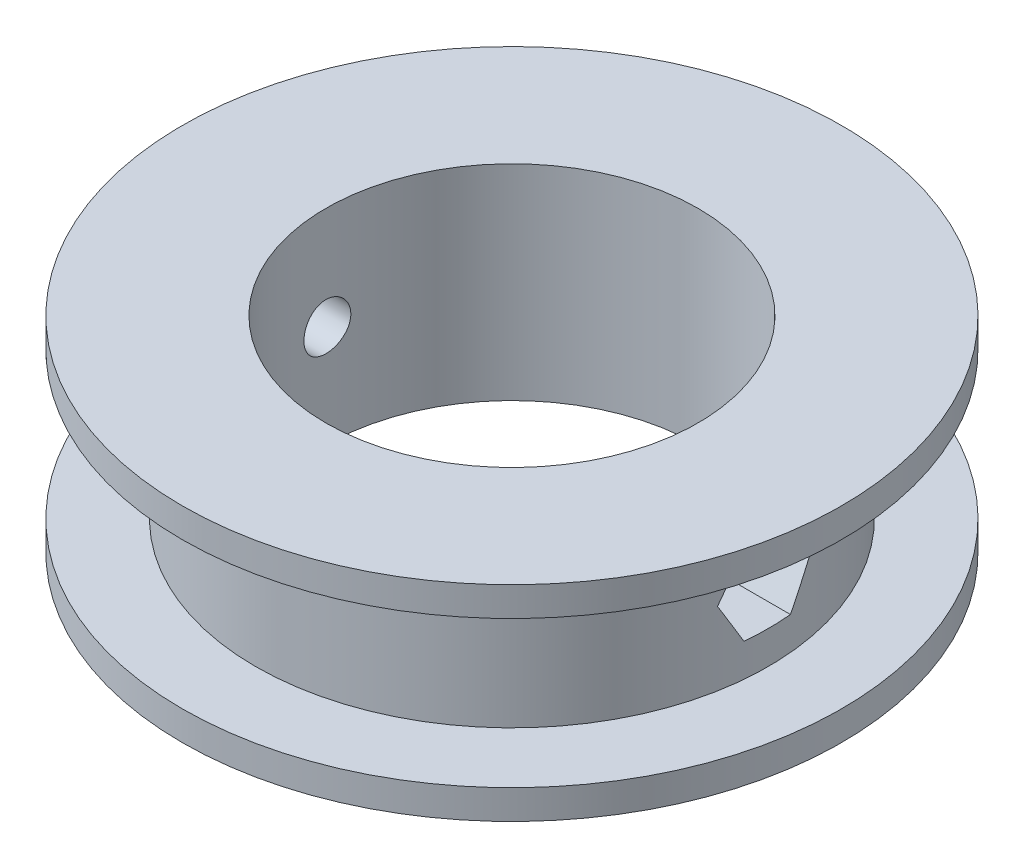
ISO-10303-21;
HEADER;
FILE_DESCRIPTION(('STEP AP214'),'2;1');
FILE_NAME('part.step','',(''),(''),'','','');
FILE_SCHEMA(('AUTOMOTIVE_DESIGN { 1 0 10303 214 1 1 1 1 }'));
ENDSEC;
DATA;
#1=APPLICATION_CONTEXT('core data for automotive mechanical design processes');
#2=APPLICATION_PROTOCOL_DEFINITION('international standard','automotive_design',2000,#1);
#3=PRODUCT_CONTEXT('',#1,'mechanical');
#4=PRODUCT('Part','Part','',(#3));
#5=PRODUCT_RELATED_PRODUCT_CATEGORY('part','',(#4));
#6=PRODUCT_DEFINITION_FORMATION('','',#4);
#7=PRODUCT_DEFINITION_CONTEXT('part definition',#1,'design');
#8=PRODUCT_DEFINITION('design','',#6,#7);
#9=PRODUCT_DEFINITION_SHAPE('','',#8);
#10=(LENGTH_UNIT() NAMED_UNIT(*) SI_UNIT(.MILLI.,.METRE.));
#11=(NAMED_UNIT(*) PLANE_ANGLE_UNIT() SI_UNIT($,.RADIAN.));
#12=(NAMED_UNIT(*) SI_UNIT($,.STERADIAN.) SOLID_ANGLE_UNIT());
#13=UNCERTAINTY_MEASURE_WITH_UNIT(LENGTH_MEASURE(1.E-05),#10,'distance_accuracy_value','');
#14=(GEOMETRIC_REPRESENTATION_CONTEXT(3) GLOBAL_UNCERTAINTY_ASSIGNED_CONTEXT((#13)) GLOBAL_UNIT_ASSIGNED_CONTEXT((#10,
#11,#12)) REPRESENTATION_CONTEXT('',''));
#15=CARTESIAN_POINT('',(0.,0.,0.));
#16=DIRECTION('',(0.,0.,1.));
#17=DIRECTION('',(1.,0.,0.));
#18=AXIS2_PLACEMENT_3D('',#15,#16,#17);
#19=CARTESIAN_POINT('',(0.,5.,0.));
#20=DIRECTION('',(0.,-1.,0.));
#21=DIRECTION('',(0.,0.,-1.));
#22=AXIS2_PLACEMENT_3D('',#19,#20,#21);
#23=CYLINDRICAL_SURFACE('',#22,17.5);
#24=CARTESIAN_POINT('',(-17.2825779327044,0.,-2.75));
#25=CARTESIAN_POINT('',(-17.2825805895696,0.153442042581324,-2.74999373034891));
#26=CARTESIAN_POINT('',(-17.2846435437698,0.306970963977942,-2.73711411245183));
#27=CARTESIAN_POINT('',(-17.292666075105,0.609729965441849,-2.68595323646897));
#28=CARTESIAN_POINT('',(-17.2986293666357,0.758955805988846,-2.64764776414423));
#29=CARTESIAN_POINT('',(-17.3137608611033,1.04868278521054,-2.54681493656312));
#30=CARTESIAN_POINT('',(-17.3229265129413,1.18919076419162,-2.48430685757308));
#31=CARTESIAN_POINT('',(-17.3434269683432,1.45770622636354,-2.33688970762635));
#32=CARTESIAN_POINT('',(-17.3547614959901,1.58571529649806,-2.25198348556577));
#33=CARTESIAN_POINT('',(-17.3784337658293,1.8267404702685,-2.06138492647557));
#34=CARTESIAN_POINT('',(-17.3907786852602,1.93963098126893,-1.95553463958274));
#35=CARTESIAN_POINT('',(-17.4150168462382,2.14612507710807,-1.7263938539673));
#36=CARTESIAN_POINT('',(-17.4269100621271,2.23972756765971,-1.603102366404));
#37=CARTESIAN_POINT('',(-17.4489802393982,2.40545539580079,-1.34177044439303));
#38=CARTESIAN_POINT('',(-17.4591477932692,2.4774645522685,-1.20365546957409));
#39=CARTESIAN_POINT('',(-17.4765413847317,2.59721556911259,-0.917104221216572));
#40=CARTESIAN_POINT('',(-17.4837675926036,2.64495883432952,-0.768668545746552));
#41=CARTESIAN_POINT('',(-17.4944136457174,2.71444063305924,-0.466984716410416));
#42=CARTESIAN_POINT('',(-17.4978643049025,2.7363897946332,-0.31378617802988));
#43=CARTESIAN_POINT('',(-17.5006761830715,2.75431474009059,-0.00584440984348317));
#44=CARTESIAN_POINT('',(-17.5000376504745,2.75029210176551,0.148898725557599));
#45=CARTESIAN_POINT('',(-17.4947676157738,2.71655303953866,0.454098783004018));
#46=CARTESIAN_POINT('',(-17.4901713348647,2.68706324875427,0.60458145352656));
#47=CARTESIAN_POINT('',(-17.4775414846515,2.60358319801336,0.898435570803033));
#48=CARTESIAN_POINT('',(-17.4695078199801,2.54959225829045,1.04180682013337));
#49=CARTESIAN_POINT('',(-17.4508455521261,2.41841333173695,1.31804929059045));
#50=CARTESIAN_POINT('',(-17.4402064042436,2.34113078023091,1.45087486452185));
#51=CARTESIAN_POINT('',(-17.4175173682006,2.16563153713493,1.70175791068199));
#52=CARTESIAN_POINT('',(-17.4054673783106,2.06741333554957,1.8198143167011));
#53=CARTESIAN_POINT('',(-17.3811454833272,1.85157060460223,2.03914507180665));
#54=CARTESIAN_POINT('',(-17.3688725866826,1.73374811385013,2.14022459556312));
#55=CARTESIAN_POINT('',(-17.3456144917806,1.48271160187598,2.32120868278056));
#56=CARTESIAN_POINT('',(-17.3346293029917,1.34949746749367,2.40111309054661));
#57=CARTESIAN_POINT('',(-17.3151903451046,1.0712465531021,2.53751003763762));
#58=CARTESIAN_POINT('',(-17.3067388973555,0.926199085495295,2.59398112603297));
#59=CARTESIAN_POINT('',(-17.2933642434654,0.628515457757791,2.68170486629699));
#60=CARTESIAN_POINT('',(-17.2884407630701,0.475879888491861,2.71295947844876));
#61=CARTESIAN_POINT('',(-17.2827319643323,0.169090277303433,2.7490928999403));
#62=CARTESIAN_POINT('',(-17.2819032171293,0.0149696200004372,2.75424853030764));
#63=CARTESIAN_POINT('',(-17.2843622624917,-0.291933785916068,2.73877348411145));
#64=CARTESIAN_POINT('',(-17.287649914389,-0.444716580068202,2.71814368870341));
#65=CARTESIAN_POINT('',(-17.2979313325471,-0.743740686187418,2.65191869631176));
#66=CARTESIAN_POINT('',(-17.3049044340258,-0.890013590270085,2.60646265626546));
#67=CARTESIAN_POINT('',(-17.3217538937273,-1.1728647192245,2.49202075358933));
#68=CARTESIAN_POINT('',(-17.3316304080729,-1.30944242227384,2.42303362560988));
#69=CARTESIAN_POINT('',(-17.3532755914614,-1.57026342019551,2.26282764429545));
#70=CARTESIAN_POINT('',(-17.365059176398,-1.69439584731303,2.17143034500166));
#71=CARTESIAN_POINT('',(-17.3891464103273,-1.92566022343115,1.96924520918163));
#72=CARTESIAN_POINT('',(-17.40145009166,-2.03279111328749,1.85845616551188));
#73=CARTESIAN_POINT('',(-17.4253276207352,-2.22801245852067,1.61941025859422));
#74=CARTESIAN_POINT('',(-17.4368937263404,-2.31591897575269,1.49100228996235));
#75=CARTESIAN_POINT('',(-17.4578710123511,-2.46891186344931,1.22108064393943));
#76=CARTESIAN_POINT('',(-17.4672822563014,-2.53399890686807,1.07956735318447));
#77=CARTESIAN_POINT('',(-17.4828556192697,-2.6392145461773,0.788014764613754));
#78=CARTESIAN_POINT('',(-17.4890305811137,-2.67944191064245,0.638011825624002));
#79=CARTESIAN_POINT('',(-17.4974897023281,-2.73411528776913,0.333275186585567));
#80=CARTESIAN_POINT('',(-17.4997741448636,-2.74856317675072,0.178541831666899));
#81=CARTESIAN_POINT('',(-17.5001915108245,-2.75121826956067,-0.129482967695254));
#82=CARTESIAN_POINT('',(-17.4983688560198,-2.73970625099108,-0.282772005113992));
#83=CARTESIAN_POINT('',(-17.4908668541199,-2.69137242444705,-0.58520519574339));
#84=CARTESIAN_POINT('',(-17.4851875230275,-2.65455072149142,-0.734349366149892));
#85=CARTESIAN_POINT('',(-17.4706075827448,-2.55674580696568,-1.02416947262133));
#86=CARTESIAN_POINT('',(-17.461709813644,-2.49578389328549,-1.16485274769007));
#87=CARTESIAN_POINT('',(-17.4416677957175,-2.35145950182709,-1.43403768262396));
#88=CARTESIAN_POINT('',(-17.4305234598058,-2.26809615563759,-1.56253886997843));
#89=CARTESIAN_POINT('',(-17.4070825714269,-2.08032820363992,-1.80513214062937));
#90=CARTESIAN_POINT('',(-17.3947753932017,-1.97571696807623,-1.91906328098401));
#91=CARTESIAN_POINT('',(-17.3704723950119,-1.74885733795565,-2.12785483520407));
#92=CARTESIAN_POINT('',(-17.3584766487013,-1.626604815249,-2.22271077290612));
#93=CARTESIAN_POINT('',(-17.3360745520905,-1.36703568770372,-2.39119403049872));
#94=CARTESIAN_POINT('',(-17.3256785395921,-1.22963021014508,-2.46468579758077));
#95=CARTESIAN_POINT('',(-17.3077745420186,-0.944322987684814,-2.58743529855431));
#96=CARTESIAN_POINT('',(-17.3002636079645,-0.796432144590057,-2.6367177923718));
#97=CARTESIAN_POINT('',(-17.290686677865,-0.539927416419488,-2.69866466762212));
#98=CARTESIAN_POINT('',(-17.2876623445896,-0.432885328618232,-2.71788537297047));
#99=CARTESIAN_POINT('',(-17.2836070463724,-0.217243329755753,-2.74355516296636));
#100=CARTESIAN_POINT('',(-17.2825760515316,-0.108643442085193,-2.75000443917758));
#101=CARTESIAN_POINT('',(-17.2825779327044,0.,-2.75));
#102=B_SPLINE_CURVE_WITH_KNOTS('',3,(#24,#25,#26,#27,#28,#29,#30,#31,#32,#33,#34,#35,#36,#37,
#38,#39,#40,#41,#42,#43,#44,#45,#46,#47,#48,#49,#50,#51,#52,#53,#54,#55,#56,#57,#58,#59,#60,#61,
#62,#63,#64,#65,#66,#67,#68,#69,#70,#71,#72,#73,#74,#75,#76,#77,#78,#79,#80,#81,#82,#83,#84,#85,
#86,#87,#88,#89,#90,#91,#92,#93,#94,#95,#96,#97,#98,#99,#100,#101),.UNSPECIFIED.,.T.,.F.,(4,2,2,
2,2,2,2,2,2,2,2,2,2,2,2,2,2,2,2,2,2,2,2,2,2,2,2,2,2,2,2,2,2,2,2,2,2,2,4),(0.,0.459928948135652,
0.92029653792692,1.38029821777602,1.8402414166318,2.30379542954695,2.76737573451166,
3.23340729811177,3.6994118783785,4.16158414370513,4.6237283322479,5.08180177228082,
5.53988792200226,5.99985956065164,6.45986438624406,6.92483271923071,7.38980447090911,
7.8552009251161,8.32056119676033,8.7809750883887,9.24137324689935,9.69921686245647,
10.1570851017625,10.6187248861304,11.0803934179787,11.5463026772245,12.0121981954892,
12.4762305858503,12.9402292009393,13.3992333912518,13.8582356770057,14.316833903432,
14.7754499103884,15.2387599757416,15.7021786343199,16.1684764682889,16.6342964001406,
16.9599503911197,17.2855994974499),.UNSPECIFIED.);
#103=CARTESIAN_POINT('',(-17.2825779327044,0.,-2.75));
#104=VERTEX_POINT('',#103);
#105=EDGE_CURVE('E45',#104,#104,#102,.T.);
#106=ORIENTED_EDGE('',*,*,#105,.T.);
#107=EDGE_LOOP('',(#106));
#108=FACE_BOUND('',#107,.T.);
#109=CARTESIAN_POINT('',(0.,-5.,0.));
#110=DIRECTION('',(0.,1.,0.));
#111=DIRECTION('',(0.,0.,1.));
#112=AXIS2_PLACEMENT_3D('',#109,#110,#111);
#113=CIRCLE('',#112,17.5);
#114=CARTESIAN_POINT('',(0.,-5.,17.5));
#115=VERTEX_POINT('',#114);
#116=EDGE_CURVE('E138',#115,#115,#113,.T.);
#117=ORIENTED_EDGE('',*,*,#116,.T.);
#118=EDGE_LOOP('',(#117));
#119=FACE_BOUND('',#118,.T.);
#120=CARTESIAN_POINT('',(0.,5.,0.));
#121=DIRECTION('',(0.,1.,0.));
#122=DIRECTION('',(0.,0.,1.));
#123=AXIS2_PLACEMENT_3D('',#120,#121,#122);
#124=CIRCLE('',#123,17.5);
#125=CARTESIAN_POINT('',(0.,5.,17.5));
#126=VERTEX_POINT('',#125);
#127=EDGE_CURVE('E151',#126,#126,#124,.T.);
#128=ORIENTED_EDGE('',*,*,#127,.F.);
#129=EDGE_LOOP('',(#128));
#130=FACE_BOUND('',#129,.T.);
#131=CARTESIAN_POINT('',(0.,-5.5,0.));
#132=DIRECTION('',(0.,0.5,0.866025403784439));
#133=DIRECTION('',(0.,-0.866025403784439,0.5));
#134=AXIS2_PLACEMENT_3D('',#131,#132,#133);
#135=ELLIPSE('',#134,35.,17.5);
#136=CARTESIAN_POINT('',(17.4278273650695,-2.75,-1.58771324027147));
#137=VERTEX_POINT('',#136);
#138=CARTESIAN_POINT('',(17.2094935040711,0.,-3.17542648054294));
#139=VERTEX_POINT('',#138);
#140=EDGE_CURVE('E110',#137,#139,#135,.T.);
#141=ORIENTED_EDGE('',*,*,#140,.F.);
#142=CARTESIAN_POINT('',(0.,-2.75,0.));
#143=DIRECTION('',(0.,1.,0.));
#144=DIRECTION('',(0.,0.,1.));
#145=AXIS2_PLACEMENT_3D('',#142,#143,#144);
#146=CIRCLE('',#145,17.5);
#147=CARTESIAN_POINT('',(17.4278273650695,-2.75,1.58771324027147));
#148=VERTEX_POINT('',#147);
#149=EDGE_CURVE('E98',#148,#137,#146,.T.);
#150=ORIENTED_EDGE('',*,*,#149,.F.);
#151=CARTESIAN_POINT('',(0.,-5.5,0.));
#152=DIRECTION('',(0.,0.5,-0.866025403784438));
#153=DIRECTION('',(0.,-0.866025403784439,-0.5));
#154=AXIS2_PLACEMENT_3D('',#151,#152,#153);
#155=ELLIPSE('',#154,35.,17.5);
#156=CARTESIAN_POINT('',(17.2094935040711,0.,3.17542648054294));
#157=VERTEX_POINT('',#156);
#158=EDGE_CURVE('E104',#157,#148,#155,.T.);
#159=ORIENTED_EDGE('',*,*,#158,.F.);
#160=CARTESIAN_POINT('',(0.,5.5,0.));
#161=DIRECTION('',(0.,-0.5,-0.866025403784439));
#162=DIRECTION('',(0.,-0.866025403784439,0.5));
#163=AXIS2_PLACEMENT_3D('',#160,#161,#162);
#164=ELLIPSE('',#163,35.,17.5);
#165=CARTESIAN_POINT('',(17.4278273650696,2.75,1.58771324027147));
#166=VERTEX_POINT('',#165);
#167=EDGE_CURVE('E268',#166,#157,#164,.T.);
#168=ORIENTED_EDGE('',*,*,#167,.F.);
#169=CARTESIAN_POINT('',(0.,2.75,0.));
#170=DIRECTION('',(0.,-1.,0.));
#171=DIRECTION('',(0.,0.,-1.));
#172=AXIS2_PLACEMENT_3D('',#169,#170,#171);
#173=CIRCLE('',#172,17.5);
#174=CARTESIAN_POINT('',(17.4278273650695,2.75,-1.58771324027147));
#175=VERTEX_POINT('',#174);
#176=EDGE_CURVE('E126',#175,#166,#173,.T.);
#177=ORIENTED_EDGE('',*,*,#176,.F.);
#178=CARTESIAN_POINT('',(0.,5.49999999999999,0.));
#179=DIRECTION('',(0.,-0.500000000000001,0.866025403784438));
#180=DIRECTION('',(0.,-0.866025403784438,-0.500000000000001));
#181=AXIS2_PLACEMENT_3D('',#178,#179,#180);
#182=ELLIPSE('',#181,35.,17.5);
#183=EDGE_CURVE('E117',#139,#175,#182,.T.);
#184=ORIENTED_EDGE('',*,*,#183,.F.);
#185=EDGE_LOOP('',(#141,#150,#159,#168,#177,#184));
#186=FACE_BOUND('',#185,.T.);
#187=ADVANCED_FACE('F41',(#108,#119,#130,#186),#23,.T.);
#188=CARTESIAN_POINT('',(0.,5.,0.));
#189=DIRECTION('',(0.,-1.,0.));
#190=DIRECTION('',(0.,0.,-1.));
#191=AXIS2_PLACEMENT_3D('',#188,#189,#190);
#192=CYLINDRICAL_SURFACE('',#191,12.7);
#193=CARTESIAN_POINT('',(-12.5988094675648,0.,-1.6));
#194=CARTESIAN_POINT('',(-12.5988107619139,0.089489240471632,-1.59999619884442));
#195=CARTESIAN_POINT('',(-12.5997732255844,0.179034268808336,-1.5924668603471));
#196=CARTESIAN_POINT('',(-12.6035175893522,0.355631857666908,-1.56255012198715));
#197=CARTESIAN_POINT('',(-12.6063013860905,0.442681721110315,-1.54014723322954));
#198=CARTESIAN_POINT('',(-12.6133682134793,0.611706590518553,-1.48115468743082));
#199=CARTESIAN_POINT('',(-12.6176502216189,0.693685012888153,-1.44457470425516));
#200=CARTESIAN_POINT('',(-12.6272297659897,0.850324567499067,-1.35828712168404));
#201=CARTESIAN_POINT('',(-12.6325271297958,0.924986938884611,-1.30858175066751));
#202=CARTESIAN_POINT('',(-12.6435742181387,1.06531443610296,-1.19715180205911));
#203=CARTESIAN_POINT('',(-12.6493261022785,1.13093197037204,-1.13536749825551));
#204=CARTESIAN_POINT('',(-12.6606147220554,1.25089600959558,-1.00166209299682));
#205=CARTESIAN_POINT('',(-12.6661514469386,1.30524195176324,-0.929740485690577));
#206=CARTESIAN_POINT('',(-12.6764080243307,1.40129100323886,-0.777502745476121));
#207=CARTESIAN_POINT('',(-12.6811250693686,1.44295101493663,-0.697159216405454));
#208=CARTESIAN_POINT('',(-12.6891870621024,1.5121695656915,-0.530546918631444));
#209=CARTESIAN_POINT('',(-12.6925320614933,1.53972863604482,-0.4442783733102));
#210=CARTESIAN_POINT('',(-12.6974578620656,1.57982073682526,-0.268751738939133));
#211=CARTESIAN_POINT('',(-12.6990479525413,1.59243291242916,-0.179511992323484));
#212=CARTESIAN_POINT('',(-12.7003164999043,1.60251850942396,-0.000169425879190601));
#213=CARTESIAN_POINT('',(-12.6999950331152,1.5999925352433,0.0899333593470661));
#214=CARTESIAN_POINT('',(-12.69748419941,1.57993692948807,0.267905782330368));
#215=CARTESIAN_POINT('',(-12.6953054298359,1.56249241783786,0.355785182747355));
#216=CARTESIAN_POINT('',(-12.6893367008979,1.51322800253584,0.527359140517639));
#217=CARTESIAN_POINT('',(-12.6855467104956,1.48140782195238,0.611053617218427));
#218=CARTESIAN_POINT('',(-12.6767631406024,1.40420493025855,0.772145249630426));
#219=CARTESIAN_POINT('',(-12.6717663025443,1.35878541910025,0.849524584091178));
#220=CARTESIAN_POINT('',(-12.6611279984468,1.25569993396159,0.99559501601579));
#221=CARTESIAN_POINT('',(-12.6554865023833,1.19803338948422,1.06428570850336));
#222=CARTESIAN_POINT('',(-12.6441439258546,1.07161413020822,1.19152911438972));
#223=CARTESIAN_POINT('',(-12.6384427036371,1.002787228132,1.25000813304771));
#224=CARTESIAN_POINT('',(-12.6276618791521,0.856255746515091,1.35459533358896));
#225=CARTESIAN_POINT('',(-12.622582278889,0.778551138348646,1.40070347558129));
#226=CARTESIAN_POINT('',(-12.613619884476,0.616403923319626,1.4792445060673));
#227=CARTESIAN_POINT('',(-12.6097376124877,0.531958396856019,1.51167143036641));
#228=CARTESIAN_POINT('',(-12.6036195769482,0.358760834034133,1.56186387149886));
#229=CARTESIAN_POINT('',(-12.6013837327484,0.270009008842401,1.57963010647581));
#230=CARTESIAN_POINT('',(-12.5988264614564,0.0913692282989178,1.59989912723952));
#231=CARTESIAN_POINT('',(-12.5984920233031,0.00149322266222689,1.60250565167959));
#232=CARTESIAN_POINT('',(-12.5997410140582,-0.177414194502011,1.59265503468336));
#233=CARTESIAN_POINT('',(-12.6013244014253,-0.266445624281463,1.58019821952774));
#234=CARTESIAN_POINT('',(-12.6062187589725,-0.440825352472905,1.54066189513727));
#235=CARTESIAN_POINT('',(-12.6095237870052,-0.526185232885548,1.51363267061259));
#236=CARTESIAN_POINT('',(-12.6174842097101,-0.691161248897752,1.44577057047199));
#237=CARTESIAN_POINT('',(-12.6221396525347,-0.770777179555788,1.40493720262576));
#238=CARTESIAN_POINT('',(-12.6323074991106,-0.922474482349391,1.31037107422323));
#239=CARTESIAN_POINT('',(-12.6378243643722,-0.994513161661921,1.25657031595675));
#240=CARTESIAN_POINT('',(-12.6490794540099,-1.12857532349501,1.13769267800216));
#241=CARTESIAN_POINT('',(-12.6548176871282,-1.19059840998189,1.07261535263012));
#242=CARTESIAN_POINT('',(-12.6659089480936,-1.30323348967093,0.932578582807023));
#243=CARTESIAN_POINT('',(-12.6712595518049,-1.35377729501868,0.857564073679564));
#244=CARTESIAN_POINT('',(-12.6809363808791,-1.44154712376207,0.700049932995283));
#245=CARTESIAN_POINT('',(-12.6852626271679,-1.47877341921894,0.617550454390846));
#246=CARTESIAN_POINT('',(-12.6923925339152,-1.53873904137985,0.44763432425812));
#247=CARTESIAN_POINT('',(-12.6952003250025,-1.56151769926519,0.360231733720643));
#248=CARTESIAN_POINT('',(-12.6989941177169,-1.59206936848298,0.182804734858416));
#249=CARTESIAN_POINT('',(-12.6999802028606,-1.59984306772099,0.0927804469180299));
#250=CARTESIAN_POINT('',(-12.7000190691985,-1.60015115568129,-0.0866688435861575));
#251=CARTESIAN_POINT('',(-12.6990851853964,-1.59279065781776,-0.176093680998703));
#252=CARTESIAN_POINT('',(-12.6954155666806,-1.56326201077065,-0.35242458084021));
#253=CARTESIAN_POINT('',(-12.6926798331591,-1.54109387302732,-0.439330645215099));
#254=CARTESIAN_POINT('',(-12.6857125414798,-1.48261238344472,-0.608142731640216));
#255=CARTESIAN_POINT('',(-12.6814815244722,-1.44630414848954,-0.690050550020271));
#256=CARTESIAN_POINT('',(-12.67199202806,-1.3605840173231,-0.846627303219375));
#257=CARTESIAN_POINT('',(-12.6667335356591,-1.31117195536273,-0.921296146456967));
#258=CARTESIAN_POINT('',(-12.6557324065832,-1.20025819864171,-1.06181225593668));
#259=CARTESIAN_POINT('',(-12.6499867834531,-1.13867830842353,-1.1275975699344));
#260=CARTESIAN_POINT('',(-12.6386828567303,-1.00533945385278,-1.24794191301122));
#261=CARTESIAN_POINT('',(-12.6331245978105,-0.933578082892394,-1.30249828039861));
#262=CARTESIAN_POINT('',(-12.6228014792665,-0.781590147883298,-1.39901945695652));
#263=CARTESIAN_POINT('',(-12.6180398169087,-0.701331486651261,-1.44093404196287));
#264=CARTESIAN_POINT('',(-12.6098864989945,-0.534899150181885,-1.51063060088132));
#265=CARTESIAN_POINT('',(-12.6064933566699,-0.448732013715521,-1.53842792043437));
#266=CARTESIAN_POINT('',(-12.6022837099225,-0.301767467192923,-1.57245838901077));
#267=CARTESIAN_POINT('',(-12.6009873725861,-0.241896412104467,-1.58277160686878));
#268=CARTESIAN_POINT('',(-12.5992498158049,-0.121358787377048,-1.59654367476827));
#269=CARTESIAN_POINT('',(-12.5988085897282,-0.0606922239115233,-1.60000257797009));
#270=CARTESIAN_POINT('',(-12.5988094675648,0.,-1.6));
#271=B_SPLINE_CURVE_WITH_KNOTS('',3,(#193,#194,#195,#196,#197,#198,#199,#200,#201,#202,#203,
#204,#205,#206,#207,#208,#209,#210,#211,#212,#213,#214,#215,#216,#217,#218,#219,#220,#221,#222,
#223,#224,#225,#226,#227,#228,#229,#230,#231,#232,#233,#234,#235,#236,#237,#238,#239,#240,#241,
#242,#243,#244,#245,#246,#247,#248,#249,#250,#251,#252,#253,#254,#255,#256,#257,#258,#259,#260,
#261,#262,#263,#264,#265,#266,#267,#268,#269,#270),.UNSPECIFIED.,.T.,.F.,(4,2,2,2,2,2,2,2,2,2,2,
2,2,2,2,2,2,2,2,2,2,2,2,2,2,2,2,2,2,2,2,2,2,2,2,2,2,2,4),(0.,0.268245998229826,
0.536771779344833,0.805114651213813,1.07341199409864,1.34307115410152,1.61274377485583,
1.88332258160523,2.15389119271717,2.42302062431787,2.69213931032531,2.95973266663371,
3.22733117805738,3.49566046310975,3.76400225034453,4.03420702574162,4.3044126724263,
4.57473599124262,4.845046067674,5.11350420221591,5.38195652190304,5.64948837289594,
5.91702976458819,6.18600582418635,6.4549925169552,6.7255374932687,6.99607694234747,
7.26587669743675,7.53566408320442,7.80358401180516,8.07150373341352,8.33932659273023,
8.60715283987567,8.8767597690206,9.146430531952,9.41715896188899,9.68759247341758,
9.86952018194076,10.0514464794725),.UNSPECIFIED.);
#272=CARTESIAN_POINT('',(-12.5988094675648,0.,-1.6));
#273=VERTEX_POINT('',#272);
#274=EDGE_CURVE('E119',#273,#273,#271,.T.);
#275=ORIENTED_EDGE('',*,*,#274,.F.);
#276=EDGE_LOOP('',(#275));
#277=FACE_BOUND('',#276,.T.);
#278=CARTESIAN_POINT('',(0.,7.,0.));
#279=DIRECTION('',(0.,1.,0.));
#280=DIRECTION('',(0.,0.,1.));
#281=AXIS2_PLACEMENT_3D('',#278,#279,#280);
#282=CIRCLE('',#281,12.7);
#283=CARTESIAN_POINT('',(0.,7.,12.7));
#284=VERTEX_POINT('',#283);
#285=EDGE_CURVE('E142',#284,#284,#282,.T.);
#286=ORIENTED_EDGE('',*,*,#285,.T.);
#287=EDGE_LOOP('',(#286));
#288=FACE_BOUND('',#287,.T.);
#289=CARTESIAN_POINT('',(0.,-7.,0.));
#290=DIRECTION('',(0.,1.,0.));
#291=DIRECTION('',(0.,0.,1.));
#292=AXIS2_PLACEMENT_3D('',#289,#290,#291);
#293=CIRCLE('',#292,12.7);
#294=CARTESIAN_POINT('',(0.,-7.,12.7));
#295=VERTEX_POINT('',#294);
#296=EDGE_CURVE('E124',#295,#295,#293,.T.);
#297=ORIENTED_EDGE('',*,*,#296,.F.);
#298=EDGE_LOOP('',(#297));
#299=FACE_BOUND('',#298,.T.);
#300=CARTESIAN_POINT('',(0.,-2.75,0.));
#301=DIRECTION('',(0.,1.,0.));
#302=DIRECTION('',(0.,0.,1.));
#303=AXIS2_PLACEMENT_3D('',#300,#301,#302);
#304=CIRCLE('',#303,12.7);
#305=CARTESIAN_POINT('',(12.6003637513632,-2.75,1.58771324027147));
#306=VERTEX_POINT('',#305);
#307=CARTESIAN_POINT('',(12.6003637513632,-2.75,-1.58771324027147));
#308=VERTEX_POINT('',#307);
#309=EDGE_CURVE('E158',#306,#308,#304,.T.);
#310=ORIENTED_EDGE('',*,*,#309,.T.);
#311=CARTESIAN_POINT('',(0.,-5.5,0.));
#312=DIRECTION('',(0.,0.5,0.866025403784439));
#313=DIRECTION('',(0.,-0.866025403784439,0.5));
#314=AXIS2_PLACEMENT_3D('',#311,#312,#313);
#315=ELLIPSE('',#314,25.4,12.7);
#316=CARTESIAN_POINT('',(12.296611999517,0.,-3.17542648054294));
#317=VERTEX_POINT('',#316);
#318=EDGE_CURVE('E11',#308,#317,#315,.T.);
#319=ORIENTED_EDGE('',*,*,#318,.T.);
#320=CARTESIAN_POINT('',(0.,5.49999999999999,0.));
#321=DIRECTION('',(0.,-0.500000000000001,0.866025403784438));
#322=DIRECTION('',(0.,-0.866025403784438,-0.500000000000001));
#323=AXIS2_PLACEMENT_3D('',#320,#321,#322);
#324=ELLIPSE('',#323,25.4,12.7);
#325=CARTESIAN_POINT('',(12.6003637513632,2.75,-1.58771324027147));
#326=VERTEX_POINT('',#325);
#327=EDGE_CURVE('E55',#317,#326,#324,.T.);
#328=ORIENTED_EDGE('',*,*,#327,.T.);
#329=CARTESIAN_POINT('',(0.,2.75,0.));
#330=DIRECTION('',(0.,-1.,0.));
#331=DIRECTION('',(0.,0.,-1.));
#332=AXIS2_PLACEMENT_3D('',#329,#330,#331);
#333=CIRCLE('',#332,12.7);
#334=CARTESIAN_POINT('',(12.6003637513632,2.75,1.58771324027147));
#335=VERTEX_POINT('',#334);
#336=EDGE_CURVE('E234',#326,#335,#333,.T.);
#337=ORIENTED_EDGE('',*,*,#336,.T.);
#338=CARTESIAN_POINT('',(0.,5.5,0.));
#339=DIRECTION('',(0.,-0.5,-0.866025403784439));
#340=DIRECTION('',(0.,-0.866025403784439,0.5));
#341=AXIS2_PLACEMENT_3D('',#338,#339,#340);
#342=ELLIPSE('',#341,25.4,12.7);
#343=CARTESIAN_POINT('',(12.2966119995171,0.,3.17542648054294));
#344=VERTEX_POINT('',#343);
#345=EDGE_CURVE('E238',#335,#344,#342,.T.);
#346=ORIENTED_EDGE('',*,*,#345,.T.);
#347=CARTESIAN_POINT('',(0.,-5.5,0.));
#348=DIRECTION('',(0.,0.5,-0.866025403784438));
#349=DIRECTION('',(0.,-0.866025403784439,-0.5));
#350=AXIS2_PLACEMENT_3D('',#347,#348,#349);
#351=ELLIPSE('',#350,25.4,12.7);
#352=EDGE_CURVE('E241',#344,#306,#351,.T.);
#353=ORIENTED_EDGE('',*,*,#352,.T.);
#354=EDGE_LOOP('',(#310,#319,#328,#337,#346,#353));
#355=FACE_BOUND('',#354,.T.);
#356=ADVANCED_FACE('F167',(#277,#288,#299,#355),#192,.F.);
#357=CARTESIAN_POINT('',(0.,7.,0.));
#358=DIRECTION('',(0.,1.,0.));
#359=DIRECTION('',(0.,0.,1.));
#360=AXIS2_PLACEMENT_3D('',#357,#358,#359);
#361=PLANE('',#360);
#362=CARTESIAN_POINT('',(0.,7.,0.));
#363=DIRECTION('',(0.,1.,0.));
#364=DIRECTION('',(0.,0.,1.));
#365=AXIS2_PLACEMENT_3D('',#362,#363,#364);
#366=CIRCLE('',#365,22.5);
#367=CARTESIAN_POINT('',(0.,7.,22.5));
#368=VERTEX_POINT('',#367);
#369=EDGE_CURVE('E147',#368,#368,#366,.T.);
#370=ORIENTED_EDGE('',*,*,#369,.T.);
#371=EDGE_LOOP('',(#370));
#372=FACE_BOUND('',#371,.T.);
#373=ORIENTED_EDGE('',*,*,#285,.F.);
#374=EDGE_LOOP('',(#373));
#375=FACE_BOUND('',#374,.T.);
#376=ADVANCED_FACE('F190',(#372,#375),#361,.T.);
#377=CARTESIAN_POINT('',(0.,5.,0.));
#378=DIRECTION('',(0.,1.,0.));
#379=DIRECTION('',(0.,0.,1.));
#380=AXIS2_PLACEMENT_3D('',#377,#378,#379);
#381=PLANE('',#380);
#382=ORIENTED_EDGE('',*,*,#127,.T.);
#383=EDGE_LOOP('',(#382));
#384=FACE_BOUND('',#383,.T.);
#385=CARTESIAN_POINT('',(0.,5.,0.));
#386=DIRECTION('',(0.,1.,0.));
#387=DIRECTION('',(0.,0.,1.));
#388=AXIS2_PLACEMENT_3D('',#385,#386,#387);
#389=CIRCLE('',#388,22.5);
#390=CARTESIAN_POINT('',(0.,5.,22.5));
#391=VERTEX_POINT('',#390);
#392=EDGE_CURVE('E146',#391,#391,#389,.T.);
#393=ORIENTED_EDGE('',*,*,#392,.F.);
#394=EDGE_LOOP('',(#393));
#395=FACE_BOUND('',#394,.T.);
#396=ADVANCED_FACE('F193',(#384,#395),#381,.F.);
#397=CARTESIAN_POINT('',(0.,7.,0.));
#398=DIRECTION('',(0.,-1.,0.));
#399=DIRECTION('',(0.,0.,-1.));
#400=AXIS2_PLACEMENT_3D('',#397,#398,#399);
#401=CYLINDRICAL_SURFACE('',#400,22.5);
#402=ORIENTED_EDGE('',*,*,#369,.F.);
#403=EDGE_LOOP('',(#402));
#404=FACE_BOUND('',#403,.T.);
#405=ORIENTED_EDGE('',*,*,#392,.T.);
#406=EDGE_LOOP('',(#405));
#407=FACE_BOUND('',#406,.T.);
#408=ADVANCED_FACE('F188',(#404,#407),#401,.T.);
#409=CARTESIAN_POINT('',(0.,-7.,0.));
#410=DIRECTION('',(0.,1.,0.));
#411=DIRECTION('',(0.,0.,1.));
#412=AXIS2_PLACEMENT_3D('',#409,#410,#411);
#413=CYLINDRICAL_SURFACE('',#412,22.5);
#414=CARTESIAN_POINT('',(0.,-7.,0.));
#415=DIRECTION('',(0.,1.,0.));
#416=DIRECTION('',(0.,0.,1.));
#417=AXIS2_PLACEMENT_3D('',#414,#415,#416);
#418=CIRCLE('',#417,22.5);
#419=CARTESIAN_POINT('',(0.,-7.,22.5));
#420=VERTEX_POINT('',#419);
#421=EDGE_CURVE('E134',#420,#420,#418,.T.);
#422=ORIENTED_EDGE('',*,*,#421,.T.);
#423=EDGE_LOOP('',(#422));
#424=FACE_BOUND('',#423,.T.);
#425=CARTESIAN_POINT('',(0.,-5.,0.));
#426=DIRECTION('',(0.,1.,0.));
#427=DIRECTION('',(0.,0.,1.));
#428=AXIS2_PLACEMENT_3D('',#425,#426,#427);
#429=CIRCLE('',#428,22.5);
#430=CARTESIAN_POINT('',(0.,-5.,22.5));
#431=VERTEX_POINT('',#430);
#432=EDGE_CURVE('E133',#431,#431,#429,.T.);
#433=ORIENTED_EDGE('',*,*,#432,.F.);
#434=EDGE_LOOP('',(#433));
#435=FACE_BOUND('',#434,.T.);
#436=ADVANCED_FACE('F181',(#424,#435),#413,.T.);
#437=CARTESIAN_POINT('',(0.,-7.,0.));
#438=DIRECTION('',(0.,-1.,0.));
#439=DIRECTION('',(0.,0.,1.));
#440=AXIS2_PLACEMENT_3D('',#437,#438,#439);
#441=PLANE('',#440);
#442=ORIENTED_EDGE('',*,*,#296,.T.);
#443=EDGE_LOOP('',(#442));
#444=FACE_BOUND('',#443,.T.);
#445=ORIENTED_EDGE('',*,*,#421,.F.);
#446=EDGE_LOOP('',(#445));
#447=FACE_BOUND('',#446,.T.);
#448=ADVANCED_FACE('F178',(#444,#447),#441,.T.);
#449=CARTESIAN_POINT('',(0.,-5.,0.));
#450=DIRECTION('',(0.,-1.,0.));
#451=DIRECTION('',(0.,0.,1.));
#452=AXIS2_PLACEMENT_3D('',#449,#450,#451);
#453=PLANE('',#452);
#454=ORIENTED_EDGE('',*,*,#116,.F.);
#455=EDGE_LOOP('',(#454));
#456=FACE_BOUND('',#455,.T.);
#457=ORIENTED_EDGE('',*,*,#432,.T.);
#458=EDGE_LOOP('',(#457));
#459=FACE_BOUND('',#458,.T.);
#460=ADVANCED_FACE('F175',(#456,#459),#453,.F.);
#461=CARTESIAN_POINT('',(-22.5,0.,0.));
#462=DIRECTION('',(1.,0.,0.));
#463=DIRECTION('',(0.,0.,-1.));
#464=AXIS2_PLACEMENT_3D('',#461,#462,#463);
#465=CYLINDRICAL_SURFACE('',#464,1.6);
#466=CARTESIAN_POINT('',(-15.,0.,0.));
#467=DIRECTION('',(1.,0.,0.));
#468=DIRECTION('',(0.,0.,-1.));
#469=AXIS2_PLACEMENT_3D('',#466,#467,#468);
#470=CIRCLE('',#469,1.6);
#471=CARTESIAN_POINT('',(-15.,0.,-1.6));
#472=VERTEX_POINT('',#471);
#473=EDGE_CURVE('E222',#472,#472,#470,.F.);
#474=ORIENTED_EDGE('',*,*,#473,.T.);
#475=EDGE_LOOP('',(#474));
#476=FACE_BOUND('',#475,.T.);
#477=ORIENTED_EDGE('',*,*,#274,.T.);
#478=EDGE_LOOP('',(#477));
#479=FACE_BOUND('',#478,.T.);
#480=ADVANCED_FACE('F170',(#476,#479),#465,.F.);
#481=CARTESIAN_POINT('',(22.5,-2.75,-1.58771324027147));
#482=DIRECTION('',(0.,0.5,0.866025403784439));
#483=DIRECTION('',(0.,-0.866025403784439,0.5));
#484=AXIS2_PLACEMENT_3D('',#481,#482,#483);
#485=PLANE('',#484);
#486=ORIENTED_EDGE('',*,*,#140,.T.);
#487=DIRECTION('',(-1.,0.,0.));
#488=VECTOR('',#487,1.);
#489=CARTESIAN_POINT('',(22.5,0.,-3.17542648054294));
#490=LINE('',#489,#488);
#491=EDGE_CURVE('E105',#139,#317,#490,.T.);
#492=ORIENTED_EDGE('',*,*,#491,.T.);
#493=ORIENTED_EDGE('',*,*,#318,.F.);
#494=DIRECTION('',(-1.,0.,0.));
#495=VECTOR('',#494,1.);
#496=CARTESIAN_POINT('',(22.5,-2.75,-1.58771324027147));
#497=LINE('',#496,#495);
#498=EDGE_CURVE('E68',#137,#308,#497,.T.);
#499=ORIENTED_EDGE('',*,*,#498,.F.);
#500=EDGE_LOOP('',(#486,#492,#493,#499));
#501=FACE_BOUND('',#500,.T.);
#502=ADVANCED_FACE('F108',(#501),#485,.T.);
#503=CARTESIAN_POINT('',(22.5,0.,-3.17542648054294));
#504=DIRECTION('',(0.,-0.500000000000001,0.866025403784438));
#505=DIRECTION('',(0.,-0.866025403784438,-0.500000000000001));
#506=AXIS2_PLACEMENT_3D('',#503,#504,#505);
#507=PLANE('',#506);
#508=ORIENTED_EDGE('',*,*,#183,.T.);
#509=DIRECTION('',(-1.,0.,0.));
#510=VECTOR('',#509,1.);
#511=CARTESIAN_POINT('',(22.5,2.75,-1.58771324027147));
#512=LINE('',#511,#510);
#513=EDGE_CURVE('E260',#175,#326,#512,.T.);
#514=ORIENTED_EDGE('',*,*,#513,.T.);
#515=ORIENTED_EDGE('',*,*,#327,.F.);
#516=ORIENTED_EDGE('',*,*,#491,.F.);
#517=EDGE_LOOP('',(#508,#514,#515,#516));
#518=FACE_BOUND('',#517,.T.);
#519=ADVANCED_FACE('F279',(#518),#507,.T.);
#520=CARTESIAN_POINT('',(22.5,2.75,-1.58771324027147));
#521=DIRECTION('',(0.,-1.,0.));
#522=DIRECTION('',(0.,0.,-1.));
#523=AXIS2_PLACEMENT_3D('',#520,#521,#522);
#524=PLANE('',#523);
#525=ORIENTED_EDGE('',*,*,#176,.T.);
#526=DIRECTION('',(-1.,0.,0.));
#527=VECTOR('',#526,1.);
#528=CARTESIAN_POINT('',(22.5,2.75,1.58771324027147));
#529=LINE('',#528,#527);
#530=EDGE_CURVE('E254',#166,#335,#529,.T.);
#531=ORIENTED_EDGE('',*,*,#530,.T.);
#532=ORIENTED_EDGE('',*,*,#336,.F.);
#533=ORIENTED_EDGE('',*,*,#513,.F.);
#534=EDGE_LOOP('',(#525,#531,#532,#533));
#535=FACE_BOUND('',#534,.T.);
#536=ADVANCED_FACE('F274',(#535),#524,.T.);
#537=CARTESIAN_POINT('',(22.5,2.75,1.58771324027147));
#538=DIRECTION('',(0.,-0.5,-0.866025403784439));
#539=DIRECTION('',(0.,0.866025403784439,-0.5));
#540=AXIS2_PLACEMENT_3D('',#537,#538,#539);
#541=PLANE('',#540);
#542=ORIENTED_EDGE('',*,*,#167,.T.);
#543=DIRECTION('',(-1.,0.,0.));
#544=VECTOR('',#543,1.);
#545=CARTESIAN_POINT('',(22.5,0.,3.17542648054294));
#546=LINE('',#545,#544);
#547=EDGE_CURVE('E251',#157,#344,#546,.T.);
#548=ORIENTED_EDGE('',*,*,#547,.T.);
#549=ORIENTED_EDGE('',*,*,#345,.F.);
#550=ORIENTED_EDGE('',*,*,#530,.F.);
#551=EDGE_LOOP('',(#542,#548,#549,#550));
#552=FACE_BOUND('',#551,.T.);
#553=ADVANCED_FACE('F277',(#552),#541,.T.);
#554=CARTESIAN_POINT('',(22.5,0.,3.17542648054294));
#555=DIRECTION('',(0.,0.5,-0.866025403784438));
#556=DIRECTION('',(0.,0.866025403784439,0.5));
#557=AXIS2_PLACEMENT_3D('',#554,#555,#556);
#558=PLANE('',#557);
#559=ORIENTED_EDGE('',*,*,#158,.T.);
#560=DIRECTION('',(-1.,0.,0.));
#561=VECTOR('',#560,1.);
#562=CARTESIAN_POINT('',(22.5,-2.75,1.58771324027147));
#563=LINE('',#562,#561);
#564=EDGE_CURVE('E63',#148,#306,#563,.T.);
#565=ORIENTED_EDGE('',*,*,#564,.T.);
#566=ORIENTED_EDGE('',*,*,#352,.F.);
#567=ORIENTED_EDGE('',*,*,#547,.F.);
#568=EDGE_LOOP('',(#559,#565,#566,#567));
#569=FACE_BOUND('',#568,.T.);
#570=ADVANCED_FACE('F247',(#569),#558,.T.);
#571=CARTESIAN_POINT('',(22.5,-2.75,1.58771324027147));
#572=DIRECTION('',(0.,1.,0.));
#573=DIRECTION('',(0.,0.,1.));
#574=AXIS2_PLACEMENT_3D('',#571,#572,#573);
#575=PLANE('',#574);
#576=ORIENTED_EDGE('',*,*,#149,.T.);
#577=ORIENTED_EDGE('',*,*,#498,.T.);
#578=ORIENTED_EDGE('',*,*,#309,.F.);
#579=ORIENTED_EDGE('',*,*,#564,.F.);
#580=EDGE_LOOP('',(#576,#577,#578,#579));
#581=FACE_BOUND('',#580,.T.);
#582=ADVANCED_FACE('F99',(#581),#575,.T.);
#583=CARTESIAN_POINT('',(-22.5,0.,0.));
#584=DIRECTION('',(1.,0.,0.));
#585=DIRECTION('',(0.,0.,-1.));
#586=AXIS2_PLACEMENT_3D('',#583,#584,#585);
#587=CYLINDRICAL_SURFACE('',#586,2.75);
#588=CARTESIAN_POINT('',(-15.,0.,0.));
#589=DIRECTION('',(1.,0.,0.));
#590=DIRECTION('',(0.,0.,-1.));
#591=AXIS2_PLACEMENT_3D('',#588,#589,#590);
#592=CIRCLE('',#591,2.75);
#593=CARTESIAN_POINT('',(-15.,0.,-2.75));
#594=VERTEX_POINT('',#593);
#595=EDGE_CURVE('E225',#594,#594,#592,.T.);
#596=ORIENTED_EDGE('',*,*,#595,.T.);
#597=EDGE_LOOP('',(#596));
#598=FACE_BOUND('',#597,.T.);
#599=ORIENTED_EDGE('',*,*,#105,.F.);
#600=EDGE_LOOP('',(#599));
#601=FACE_BOUND('',#600,.T.);
#602=ADVANCED_FACE('F292',(#598,#601),#587,.F.);
#603=CARTESIAN_POINT('',(-15.,0.,0.));
#604=DIRECTION('',(1.,0.,0.));
#605=DIRECTION('',(0.,0.,-1.));
#606=AXIS2_PLACEMENT_3D('',#603,#604,#605);
#607=PLANE('',#606);
#608=ORIENTED_EDGE('',*,*,#595,.F.);
#609=EDGE_LOOP('',(#608));
#610=FACE_BOUND('',#609,.T.);
#611=ORIENTED_EDGE('',*,*,#473,.F.);
#612=EDGE_LOOP('',(#611));
#613=FACE_BOUND('',#612,.T.);
#614=ADVANCED_FACE('F296',(#610,#613),#607,.F.);
#615=CLOSED_SHELL('',(#187,#356,#376,#396,#408,#436,#448,#460,#480,#502,#519,#536,#553,#570,
#582,#602,#614));
#616=MANIFOLD_SOLID_BREP('B2',#615);
#617=ADVANCED_BREP_SHAPE_REPRESENTATION('',(#18,#616),#14);
#618=SHAPE_DEFINITION_REPRESENTATION(#9,#617);
ENDSEC;
END-ISO-10303-21;
